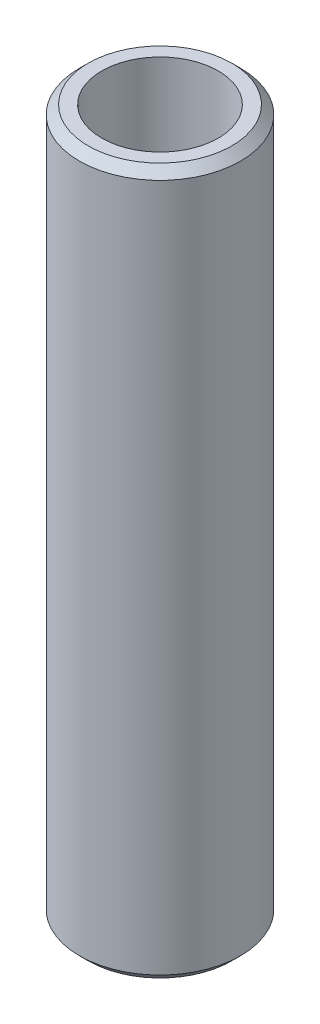
ISO-10303-21;
HEADER;
FILE_DESCRIPTION(('STEP AP214'),'2;1');
FILE_NAME('part.step','',(''),(''),'','','');
FILE_SCHEMA(('AUTOMOTIVE_DESIGN { 1 0 10303 214 1 1 1 1 }'));
ENDSEC;
DATA;
#1=APPLICATION_CONTEXT('core data for automotive mechanical design processes');
#2=APPLICATION_PROTOCOL_DEFINITION('international standard','automotive_design',2000,#1);
#3=PRODUCT_CONTEXT('',#1,'mechanical');
#4=PRODUCT('Part','Part','',(#3));
#5=PRODUCT_RELATED_PRODUCT_CATEGORY('part','',(#4));
#6=PRODUCT_DEFINITION_FORMATION('','',#4);
#7=PRODUCT_DEFINITION_CONTEXT('part definition',#1,'design');
#8=PRODUCT_DEFINITION('design','',#6,#7);
#9=PRODUCT_DEFINITION_SHAPE('','',#8);
#10=(LENGTH_UNIT() NAMED_UNIT(*) SI_UNIT(.MILLI.,.METRE.));
#11=(NAMED_UNIT(*) PLANE_ANGLE_UNIT() SI_UNIT($,.RADIAN.));
#12=(NAMED_UNIT(*) SI_UNIT($,.STERADIAN.) SOLID_ANGLE_UNIT());
#13=UNCERTAINTY_MEASURE_WITH_UNIT(LENGTH_MEASURE(1.E-05),#10,'distance_accuracy_value','');
#14=(GEOMETRIC_REPRESENTATION_CONTEXT(3) GLOBAL_UNCERTAINTY_ASSIGNED_CONTEXT((#13)) GLOBAL_UNIT_ASSIGNED_CONTEXT((#10,
#11,#12)) REPRESENTATION_CONTEXT('',''));
#15=CARTESIAN_POINT('',(0.,0.,0.));
#16=DIRECTION('',(0.,0.,1.));
#17=DIRECTION('',(1.,0.,0.));
#18=AXIS2_PLACEMENT_3D('',#15,#16,#17);
#19=CARTESIAN_POINT('',(0.,481.983862890546,0.));
#20=DIRECTION('',(0.,-1.,0.));
#21=DIRECTION('',(0.,0.,-1.));
#22=AXIS2_PLACEMENT_3D('',#19,#20,#21);
#23=CYLINDRICAL_SURFACE('',#22,55.);
#24=CARTESIAN_POINT('',(0.,475.987849408729,0.));
#25=DIRECTION('',(0.,1.,0.));
#26=DIRECTION('',(0.,0.,1.));
#27=AXIS2_PLACEMENT_3D('',#24,#25,#26);
#28=CIRCLE('',#27,55.);
#29=CARTESIAN_POINT('',(0.,475.987849408729,-55.));
#30=VERTEX_POINT('',#29);
#31=EDGE_CURVE('E50',#30,#30,#28,.F.);
#32=ORIENTED_EDGE('',*,*,#31,.T.);
#33=EDGE_LOOP('',(#32));
#34=FACE_BOUND('',#33,.T.);
#35=CARTESIAN_POINT('',(0.,5.99601348181755,0.));
#36=DIRECTION('',(0.,1.,0.));
#37=DIRECTION('',(0.,0.,1.));
#38=AXIS2_PLACEMENT_3D('',#35,#36,#37);
#39=CIRCLE('',#38,55.);
#40=CARTESIAN_POINT('',(0.,5.99601348181755,55.));
#41=VERTEX_POINT('',#40);
#42=EDGE_CURVE('E51',#41,#41,#39,.T.);
#43=ORIENTED_EDGE('',*,*,#42,.T.);
#44=EDGE_LOOP('',(#43));
#45=FACE_BOUND('',#44,.T.);
#46=ADVANCED_FACE('F39',(#34,#45),#23,.T.);
#47=CARTESIAN_POINT('',(0.,481.983862890546,0.));
#48=DIRECTION('',(0.,1.,0.));
#49=DIRECTION('',(0.,0.,1.));
#50=AXIS2_PLACEMENT_3D('',#47,#48,#49);
#51=PLANE('',#50);
#52=CARTESIAN_POINT('',(0.,481.983862890546,0.));
#53=DIRECTION('',(0.,1.,0.));
#54=DIRECTION('',(0.,0.,1.));
#55=AXIS2_PLACEMENT_3D('',#52,#53,#54);
#56=CIRCLE('',#55,49.0039865181823);
#57=CARTESIAN_POINT('',(0.,481.983862890546,-49.0039865181823));
#58=VERTEX_POINT('',#57);
#59=EDGE_CURVE('E54',#58,#58,#56,.T.);
#60=ORIENTED_EDGE('',*,*,#59,.T.);
#61=EDGE_LOOP('',(#60));
#62=FACE_BOUND('',#61,.T.);
#63=CARTESIAN_POINT('',(0.,481.983862890546,0.));
#64=DIRECTION('',(0.,1.,0.));
#65=DIRECTION('',(0.,0.,1.));
#66=AXIS2_PLACEMENT_3D('',#63,#64,#65);
#67=CIRCLE('',#66,39.7927867328488);
#68=CARTESIAN_POINT('',(0.,481.983862890546,39.7927867328488));
#69=VERTEX_POINT('',#68);
#70=EDGE_CURVE('E58',#69,#69,#67,.T.);
#71=ORIENTED_EDGE('',*,*,#70,.F.);
#72=EDGE_LOOP('',(#71));
#73=FACE_BOUND('',#72,.T.);
#74=ADVANCED_FACE('F69',(#62,#73),#51,.T.);
#75=CARTESIAN_POINT('',(0.,0.,0.));
#76=DIRECTION('',(0.,1.,0.));
#77=DIRECTION('',(0.,0.,1.));
#78=AXIS2_PLACEMENT_3D('',#75,#76,#77);
#79=PLANE('',#78);
#80=CARTESIAN_POINT('',(0.,0.,0.));
#81=DIRECTION('',(0.,1.,0.));
#82=DIRECTION('',(0.,0.,1.));
#83=AXIS2_PLACEMENT_3D('',#80,#81,#82);
#84=CIRCLE('',#83,49.0039865181824);
#85=CARTESIAN_POINT('',(0.,0.,49.0039865181824));
#86=VERTEX_POINT('',#85);
#87=EDGE_CURVE('E10',#86,#86,#84,.F.);
#88=ORIENTED_EDGE('',*,*,#87,.T.);
#89=EDGE_LOOP('',(#88));
#90=FACE_BOUND('',#89,.T.);
#91=CARTESIAN_POINT('',(0.,0.,0.));
#92=DIRECTION('',(0.,1.,0.));
#93=DIRECTION('',(0.,0.,1.));
#94=AXIS2_PLACEMENT_3D('',#91,#92,#93);
#95=CIRCLE('',#94,39.7927867328488);
#96=CARTESIAN_POINT('',(0.,0.,39.7927867328488));
#97=VERTEX_POINT('',#96);
#98=EDGE_CURVE('E63',#97,#97,#95,.T.);
#99=ORIENTED_EDGE('',*,*,#98,.T.);
#100=EDGE_LOOP('',(#99));
#101=FACE_BOUND('',#100,.T.);
#102=ADVANCED_FACE('F75',(#90,#101),#79,.F.);
#103=CARTESIAN_POINT('',(0.,481.983862890546,0.));
#104=DIRECTION('',(0.,-1.,0.));
#105=DIRECTION('',(0.,0.,-1.));
#106=AXIS2_PLACEMENT_3D('',#103,#104,#105);
#107=CYLINDRICAL_SURFACE('',#106,39.7927867328488);
#108=ORIENTED_EDGE('',*,*,#70,.T.);
#109=EDGE_LOOP('',(#108));
#110=FACE_BOUND('',#109,.T.);
#111=ORIENTED_EDGE('',*,*,#98,.F.);
#112=EDGE_LOOP('',(#111));
#113=FACE_BOUND('',#112,.T.);
#114=ADVANCED_FACE('F70',(#110,#113),#107,.F.);
#115=CARTESIAN_POINT('',(0.,481.983862890546,0.));
#116=DIRECTION('',(0.,-1.,0.));
#117=DIRECTION('',(0.,0.,-1.));
#118=AXIS2_PLACEMENT_3D('',#115,#116,#117);
#119=CONICAL_SURFACE('',#118,49.0039865181823,0.78539816339744);
#120=CARTESIAN_POINT('',(0.,475.987849408729,-55.));
#121=CARTESIAN_POINT('',(0.,476.050307882497,-54.9375415262311));
#122=CARTESIAN_POINT('',(0.,476.112766356266,-54.8750830524622));
#123=CARTESIAN_POINT('',(0.,476.237683303804,-54.7501661049243));
#124=CARTESIAN_POINT('',(0.,476.300141777573,-54.6877076311554));
#125=CARTESIAN_POINT('',(0.,476.425058725111,-54.5627906836175));
#126=CARTESIAN_POINT('',(0.,476.48751719888,-54.5003322098486));
#127=CARTESIAN_POINT('',(0.,476.612434146418,-54.3754152623107));
#128=CARTESIAN_POINT('',(0.,476.674892620187,-54.3129567885417));
#129=CARTESIAN_POINT('',(0.,476.799809567725,-54.1880398410039));
#130=CARTESIAN_POINT('',(0.,476.862268041494,-54.1255813672349));
#131=CARTESIAN_POINT('',(0.,476.987184989032,-54.0006644196971));
#132=CARTESIAN_POINT('',(0.,477.0496434628,-53.9382059459281));
#133=CARTESIAN_POINT('',(0.,477.174560410338,-53.8132889983903));
#134=CARTESIAN_POINT('',(0.,477.237018884107,-53.7508305246213));
#135=CARTESIAN_POINT('',(0.,477.361935831645,-53.6259135770835));
#136=CARTESIAN_POINT('',(0.,477.424394305414,-53.5634551033145));
#137=CARTESIAN_POINT('',(0.,477.549311252952,-53.4385381557767));
#138=CARTESIAN_POINT('',(0.,477.611769726721,-53.3760796820077));
#139=CARTESIAN_POINT('',(0.,477.736686674259,-53.2511627344699));
#140=CARTESIAN_POINT('',(0.,477.799145148028,-53.1887042607009));
#141=CARTESIAN_POINT('',(0.,477.924062095566,-53.0637873131631));
#142=CARTESIAN_POINT('',(0.,477.986520569335,-53.0013288393941));
#143=CARTESIAN_POINT('',(0.,478.111437516872,-52.8764118918562));
#144=CARTESIAN_POINT('',(0.,478.173895990641,-52.8139534180873));
#145=CARTESIAN_POINT('',(0.,478.298812938179,-52.6890364705494));
#146=CARTESIAN_POINT('',(0.,478.361271411948,-52.6265779967805));
#147=CARTESIAN_POINT('',(0.,478.486188359486,-52.5016610492426));
#148=CARTESIAN_POINT('',(0.,478.548646833255,-52.4392025754737));
#149=CARTESIAN_POINT('',(0.,478.673563780793,-52.3142856279358));
#150=CARTESIAN_POINT('',(0.,478.736022254562,-52.2518271541669));
#151=CARTESIAN_POINT('',(0.,478.8609392021,-52.126910206629));
#152=CARTESIAN_POINT('',(0.,478.923397675869,-52.0644517328601));
#153=CARTESIAN_POINT('',(0.,479.048314623406,-51.9395347853222));
#154=CARTESIAN_POINT('',(0.,479.110773097175,-51.8770763115533));
#155=CARTESIAN_POINT('',(0.,479.235690044713,-51.7521593640154));
#156=CARTESIAN_POINT('',(0.,479.298148518482,-51.6897008902465));
#157=CARTESIAN_POINT('',(0.,479.42306546602,-51.5647839427086));
#158=CARTESIAN_POINT('',(0.,479.485523939789,-51.5023254689397));
#159=CARTESIAN_POINT('',(0.,479.610440887327,-51.3774085214018));
#160=CARTESIAN_POINT('',(0.,479.672899361096,-51.3149500476329));
#161=CARTESIAN_POINT('',(0.,479.797816308634,-51.190033100095));
#162=CARTESIAN_POINT('',(0.,479.860274782403,-51.1275746263261));
#163=CARTESIAN_POINT('',(0.,479.98519172994,-51.0026576787882));
#164=CARTESIAN_POINT('',(0.,480.047650203709,-50.9401992050193));
#165=CARTESIAN_POINT('',(0.,480.172567151247,-50.8152822574814));
#166=CARTESIAN_POINT('',(0.,480.235025625016,-50.7528237837125));
#167=CARTESIAN_POINT('',(0.,480.359942572554,-50.6279068361746));
#168=CARTESIAN_POINT('',(0.,480.422401046323,-50.5654483624057));
#169=CARTESIAN_POINT('',(0.,480.547317993861,-50.4405314148678));
#170=CARTESIAN_POINT('',(0.,480.60977646763,-50.3780729410989));
#171=CARTESIAN_POINT('',(0.,480.734693415168,-50.253155993561));
#172=CARTESIAN_POINT('',(0.,480.797151888937,-50.1906975197921));
#173=CARTESIAN_POINT('',(0.,480.922068836474,-50.0657805722542));
#174=CARTESIAN_POINT('',(0.,480.984527310243,-50.0033220984853));
#175=CARTESIAN_POINT('',(0.,481.109444257781,-49.8784051509474));
#176=CARTESIAN_POINT('',(0.,481.17190273155,-49.8159466771785));
#177=CARTESIAN_POINT('',(0.,481.296819679088,-49.6910297296406));
#178=CARTESIAN_POINT('',(0.,481.359278152857,-49.6285712558716));
#179=CARTESIAN_POINT('',(0.,481.484195100395,-49.5036543083338));
#180=CARTESIAN_POINT('',(0.,481.546653574164,-49.4411958345649));
#181=CARTESIAN_POINT('',(0.,481.671570521702,-49.316278887027));
#182=CARTESIAN_POINT('',(0.,481.734028995471,-49.253820413258));
#183=CARTESIAN_POINT('',(0.,481.858945943009,-49.1289034657202));
#184=CARTESIAN_POINT('',(0.,481.921404416777,-49.0664449919512));
#185=CARTESIAN_POINT('',(0.,481.983862890546,-49.0039865181823));
#186=B_SPLINE_CURVE_WITH_KNOTS('',3,(#120,#121,#122,#123,#124,#125,#126,#127,#128,#129,#130,
#131,#132,#133,#134,#135,#136,#137,#138,#139,#140,#141,#142,#143,#144,#145,#146,#147,#148,#149,
#150,#151,#152,#153,#154,#155,#156,#157,#158,#159,#160,#161,#162,#163,#164,#165,#166,#167,#168,
#169,#170,#171,#172,#173,#174,#175,#176,#177,#178,#179,#180,#181,#182,#183,#184,#185),
.UNSPECIFIED.,.F.,.F.,(4,2,2,2,2,2,2,2,2,2,2,2,2,2,2,2,2,2,2,2,2,2,2,2,2,2,2,2,2,2,2,2,4),(0.,
0.264988862067423,0.529977724134884,0.794966586202341,1.0599554482698,1.32494431033726,
1.58993317240473,1.85492203447218,2.11991089653965,2.38489975860711,2.64988862067457,
2.91487748274199,3.17986634480945,3.44485520687691,3.70984406894437,3.97483293101183,
4.2398217930793,4.50481065514675,4.76979951721422,5.03478837928168,5.29977724134914,
5.56476610341659,5.82975496548402,6.09474382755148,6.35973268961894,6.6247215516864,
6.88971041375386,7.15469927582132,7.41968813788878,7.68467699995624,7.9496658620237,
8.21465472409116,8.47964358615862),.UNSPECIFIED.);
#187=EDGE_CURVE('BSEAM81',#30,#58,#186,.T.);
#188=ORIENTED_EDGE('',*,*,#31,.F.);
#189=ORIENTED_EDGE('',*,*,#59,.F.);
#190=ORIENTED_EDGE('',*,*,#187,.T.);
#191=ORIENTED_EDGE('',*,*,#187,.F.);
#192=EDGE_LOOP('',(#188,#190,#189,#191));
#193=FACE_BOUND('',#192,.T.);
#194=ADVANCED_FACE('F81',(#193),#119,.T.);
#195=CARTESIAN_POINT('',(0.,5.99601348181755,0.));
#196=DIRECTION('',(0.,1.,0.));
#197=DIRECTION('',(0.,0.,1.));
#198=AXIS2_PLACEMENT_3D('',#195,#196,#197);
#199=CONICAL_SURFACE('',#198,55.,0.785398163397449);
#200=ORIENTED_EDGE('',*,*,#87,.F.);
#201=EDGE_LOOP('',(#200));
#202=FACE_BOUND('',#201,.T.);
#203=ORIENTED_EDGE('',*,*,#42,.F.);
#204=EDGE_LOOP('',(#203));
#205=FACE_BOUND('',#204,.T.);
#206=ADVANCED_FACE('F45',(#202,#205),#199,.T.);
#207=CLOSED_SHELL('',(#46,#74,#102,#114,#194,#206));
#208=MANIFOLD_SOLID_BREP('B2',#207);
#209=ADVANCED_BREP_SHAPE_REPRESENTATION('',(#18,#208),#14);
#210=SHAPE_DEFINITION_REPRESENTATION(#9,#209);
ENDSEC;
END-ISO-10303-21;
